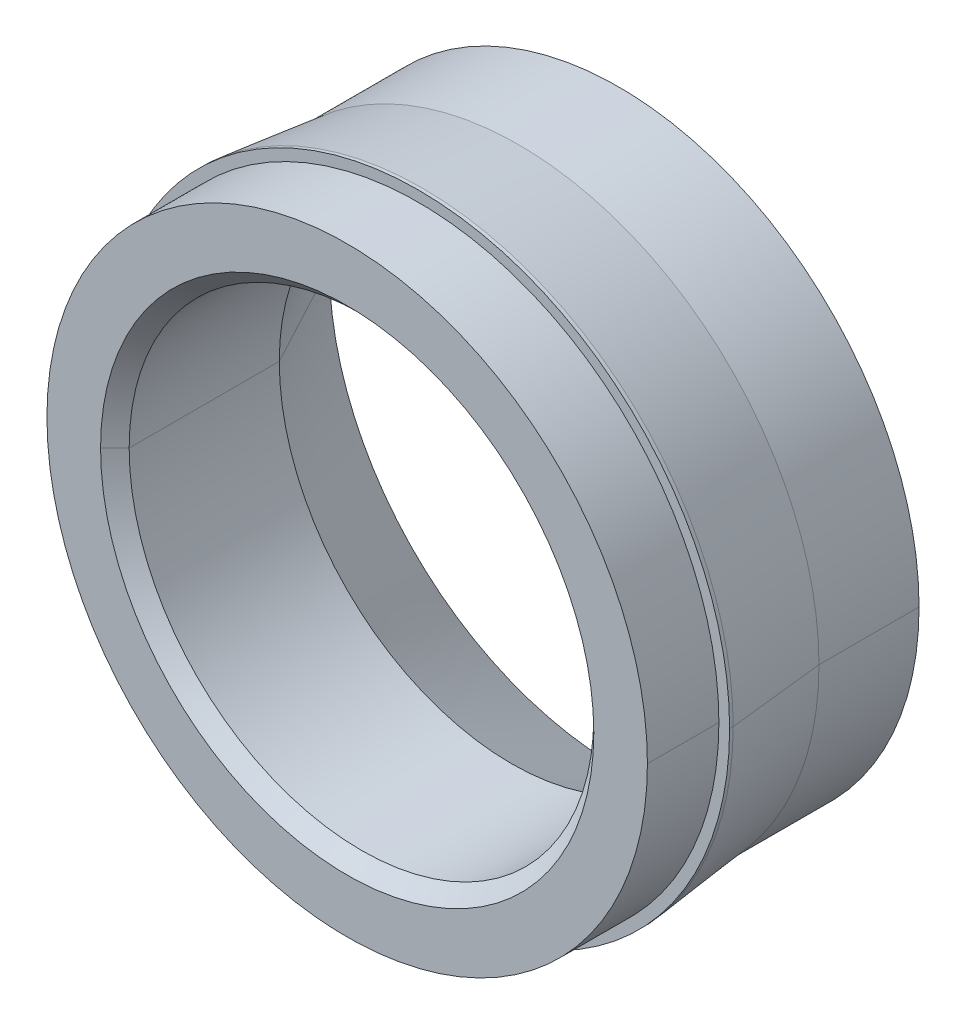
ISO-10303-21;
HEADER;
FILE_DESCRIPTION(('STEP AP214'),'2;1');
FILE_NAME('part.step','',(''),(''),'','','');
FILE_SCHEMA(('AUTOMOTIVE_DESIGN { 1 0 10303 214 1 1 1 1 }'));
ENDSEC;
DATA;
#1=APPLICATION_CONTEXT('core data for automotive mechanical design processes');
#2=APPLICATION_PROTOCOL_DEFINITION('international standard','automotive_design',2000,#1);
#3=PRODUCT_CONTEXT('',#1,'mechanical');
#4=PRODUCT('Part','Part','',(#3));
#5=PRODUCT_RELATED_PRODUCT_CATEGORY('part','',(#4));
#6=PRODUCT_DEFINITION_FORMATION('','',#4);
#7=PRODUCT_DEFINITION_CONTEXT('part definition',#1,'design');
#8=PRODUCT_DEFINITION('design','',#6,#7);
#9=PRODUCT_DEFINITION_SHAPE('','',#8);
#10=(LENGTH_UNIT() NAMED_UNIT(*) SI_UNIT(.MILLI.,.METRE.));
#11=(NAMED_UNIT(*) PLANE_ANGLE_UNIT() SI_UNIT($,.RADIAN.));
#12=(NAMED_UNIT(*) SI_UNIT($,.STERADIAN.) SOLID_ANGLE_UNIT());
#13=UNCERTAINTY_MEASURE_WITH_UNIT(LENGTH_MEASURE(1.E-05),#10,'distance_accuracy_value','');
#14=(GEOMETRIC_REPRESENTATION_CONTEXT(3) GLOBAL_UNCERTAINTY_ASSIGNED_CONTEXT((#13)) GLOBAL_UNIT_ASSIGNED_CONTEXT((#10,
#11,#12)) REPRESENTATION_CONTEXT('',''));
#15=CARTESIAN_POINT('',(0.,0.,0.));
#16=DIRECTION('',(0.,0.,1.));
#17=DIRECTION('',(1.,0.,0.));
#18=AXIS2_PLACEMENT_3D('',#15,#16,#17);
#19=CARTESIAN_POINT('',(0.,0.,2.075));
#20=DIRECTION('',(0.,0.,1.));
#21=DIRECTION('',(1.,0.,0.));
#22=AXIS2_PLACEMENT_3D('',#19,#20,#21);
#23=CONICAL_SURFACE('',#22,4.275,0.110657221173895);
#24=DIRECTION('',(-0.110431526074846,0.,0.993883734673619));
#25=VECTOR('',#24,1.);
#26=CARTESIAN_POINT('',(-4.275,0.,2.075));
#27=LINE('',#26,#25);
#28=CARTESIAN_POINT('',(-4.2,0.,1.4));
#29=VERTEX_POINT('',#28);
#30=CARTESIAN_POINT('',(-4.35,0.,2.75));
#31=VERTEX_POINT('',#30);
#32=EDGE_CURVE('E172',#29,#31,#27,.T.);
#33=ORIENTED_EDGE('',*,*,#32,.F.);
#34=CARTESIAN_POINT('',(0.,0.,1.4));
#35=DIRECTION('',(0.,0.,-1.));
#36=DIRECTION('',(1.,0.,0.));
#37=AXIS2_PLACEMENT_3D('',#34,#35,#36);
#38=CIRCLE('',#37,4.2);
#39=CARTESIAN_POINT('',(4.2,0.,1.4));
#40=VERTEX_POINT('',#39);
#41=EDGE_CURVE('E28',#40,#29,#38,.T.);
#42=ORIENTED_EDGE('',*,*,#41,.F.);
#43=DIRECTION('',(0.110431526074846,0.,0.993883734673619));
#44=VECTOR('',#43,1.);
#45=CARTESIAN_POINT('',(4.275,0.,2.075));
#46=LINE('',#45,#44);
#47=CARTESIAN_POINT('',(4.35,0.,2.75));
#48=VERTEX_POINT('',#47);
#49=EDGE_CURVE('E226',#40,#48,#46,.T.);
#50=ORIENTED_EDGE('',*,*,#49,.T.);
#51=CARTESIAN_POINT('',(0.,0.,2.75));
#52=DIRECTION('',(0.,0.,-1.));
#53=DIRECTION('',(1.,0.,0.));
#54=AXIS2_PLACEMENT_3D('',#51,#52,#53);
#55=CIRCLE('',#54,4.35);
#56=EDGE_CURVE('E159',#48,#31,#55,.T.);
#57=ORIENTED_EDGE('',*,*,#56,.T.);
#58=EDGE_LOOP('',(#33,#42,#50,#57));
#59=FACE_BOUND('',#58,.T.);
#60=ADVANCED_FACE('F17',(#59),#23,.T.);
#61=CARTESIAN_POINT('',(0.,0.,2.8));
#62=DIRECTION('',(0.,0.,-1.));
#63=DIRECTION('',(1.,0.,0.));
#64=AXIS2_PLACEMENT_3D('',#61,#62,#63);
#65=CYLINDRICAL_SURFACE('',#64,4.35);
#66=DIRECTION('',(0.,0.,-1.));
#67=VECTOR('',#66,1.);
#68=CARTESIAN_POINT('',(-4.35,0.,2.8));
#69=LINE('',#68,#67);
#70=CARTESIAN_POINT('',(-4.35,0.,2.8));
#71=VERTEX_POINT('',#70);
#72=EDGE_CURVE('E156',#71,#31,#69,.T.);
#73=ORIENTED_EDGE('',*,*,#72,.F.);
#74=CARTESIAN_POINT('',(0.,0.,2.8));
#75=DIRECTION('',(0.,0.,1.));
#76=DIRECTION('',(1.,0.,0.));
#77=AXIS2_PLACEMENT_3D('',#74,#75,#76);
#78=CIRCLE('',#77,4.35);
#79=CARTESIAN_POINT('',(4.35,0.,2.8));
#80=VERTEX_POINT('',#79);
#81=EDGE_CURVE('E11',#80,#71,#78,.T.);
#82=ORIENTED_EDGE('',*,*,#81,.F.);
#83=DIRECTION('',(0.,0.,-1.));
#84=VECTOR('',#83,1.);
#85=CARTESIAN_POINT('',(4.35,0.,2.8));
#86=LINE('',#85,#84);
#87=EDGE_CURVE('E193',#80,#48,#86,.T.);
#88=ORIENTED_EDGE('',*,*,#87,.T.);
#89=CARTESIAN_POINT('',(0.,0.,2.75));
#90=DIRECTION('',(0.,0.,-1.));
#91=DIRECTION('',(1.,0.,0.));
#92=AXIS2_PLACEMENT_3D('',#89,#90,#91);
#93=CIRCLE('',#92,4.35);
#94=EDGE_CURVE('E176',#31,#48,#93,.T.);
#95=ORIENTED_EDGE('',*,*,#94,.F.);
#96=EDGE_LOOP('',(#73,#82,#88,#95));
#97=FACE_BOUND('',#96,.T.);
#98=ADVANCED_FACE('F272',(#97),#65,.T.);
#99=CARTESIAN_POINT('',(0.,0.,2.8));
#100=DIRECTION('',(0.,0.,1.));
#101=DIRECTION('',(1.,0.,0.));
#102=AXIS2_PLACEMENT_3D('',#99,#100,#101);
#103=PLANE('',#102);
#104=CARTESIAN_POINT('',(0.,0.,2.8));
#105=DIRECTION('',(0.,0.,1.));
#106=DIRECTION('',(1.,0.,0.));
#107=AXIS2_PLACEMENT_3D('',#104,#105,#106);
#108=CIRCLE('',#107,4.2);
#109=CARTESIAN_POINT('',(4.2,0.,2.8));
#110=VERTEX_POINT('',#109);
#111=CARTESIAN_POINT('',(-4.2,0.,2.8));
#112=VERTEX_POINT('',#111);
#113=EDGE_CURVE('E192',#110,#112,#108,.T.);
#114=ORIENTED_EDGE('',*,*,#113,.F.);
#115=CARTESIAN_POINT('',(0.,0.,2.8));
#116=DIRECTION('',(0.,0.,1.));
#117=DIRECTION('',(1.,0.,0.));
#118=AXIS2_PLACEMENT_3D('',#115,#116,#117);
#119=CIRCLE('',#118,4.2);
#120=EDGE_CURVE('E79',#112,#110,#119,.T.);
#121=ORIENTED_EDGE('',*,*,#120,.F.);
#122=EDGE_LOOP('',(#114,#121));
#123=FACE_BOUND('',#122,.T.);
#124=ORIENTED_EDGE('',*,*,#81,.T.);
#125=CARTESIAN_POINT('',(0.,0.,2.8));
#126=DIRECTION('',(0.,0.,1.));
#127=DIRECTION('',(1.,0.,0.));
#128=AXIS2_PLACEMENT_3D('',#125,#126,#127);
#129=CIRCLE('',#128,4.35);
#130=EDGE_CURVE('E160',#71,#80,#129,.T.);
#131=ORIENTED_EDGE('',*,*,#130,.T.);
#132=EDGE_LOOP('',(#124,#131));
#133=FACE_BOUND('',#132,.T.);
#134=ADVANCED_FACE('F316',(#123,#133),#103,.T.);
#135=CARTESIAN_POINT('',(0.,0.,0.));
#136=DIRECTION('',(0.,0.,1.));
#137=DIRECTION('',(1.,0.,0.));
#138=AXIS2_PLACEMENT_3D('',#135,#136,#137);
#139=CYLINDRICAL_SURFACE('',#138,4.2);
#140=DIRECTION('',(0.,0.,1.));
#141=VECTOR('',#140,1.);
#142=CARTESIAN_POINT('',(-4.2,0.,0.));
#143=LINE('',#142,#141);
#144=CARTESIAN_POINT('',(-4.2,0.,0.));
#145=VERTEX_POINT('',#144);
#146=EDGE_CURVE('E180',#145,#29,#143,.T.);
#147=ORIENTED_EDGE('',*,*,#146,.F.);
#148=CARTESIAN_POINT('',(0.,0.,0.));
#149=DIRECTION('',(0.,0.,1.));
#150=DIRECTION('',(1.,0.,0.));
#151=AXIS2_PLACEMENT_3D('',#148,#149,#150);
#152=CIRCLE('',#151,4.2);
#153=CARTESIAN_POINT('',(4.2,0.,0.));
#154=VERTEX_POINT('',#153);
#155=EDGE_CURVE('E132',#145,#154,#152,.T.);
#156=ORIENTED_EDGE('',*,*,#155,.T.);
#157=DIRECTION('',(0.,0.,1.));
#158=VECTOR('',#157,1.);
#159=CARTESIAN_POINT('',(4.2,0.,0.));
#160=LINE('',#159,#158);
#161=EDGE_CURVE('E183',#154,#40,#160,.T.);
#162=ORIENTED_EDGE('',*,*,#161,.T.);
#163=ORIENTED_EDGE('',*,*,#41,.T.);
#164=EDGE_LOOP('',(#147,#156,#162,#163));
#165=FACE_BOUND('',#164,.T.);
#166=ADVANCED_FACE('F292',(#165),#139,.T.);
#167=CARTESIAN_POINT('',(0.,0.,0.75));
#168=DIRECTION('',(0.,0.,-1.));
#169=DIRECTION('',(1.,0.,0.));
#170=AXIS2_PLACEMENT_3D('',#167,#168,#169);
#171=CONICAL_SURFACE('',#170,3.65,0.489957326253728);
#172=DIRECTION('',(-0.470588235294117,0.,-0.882352941176471));
#173=VECTOR('',#172,1.);
#174=CARTESIAN_POINT('',(-3.65,0.,0.75));
#175=LINE('',#174,#173);
#176=CARTESIAN_POINT('',(-3.25,0.,1.5));
#177=VERTEX_POINT('',#176);
#178=CARTESIAN_POINT('',(-4.05,0.,0.));
#179=VERTEX_POINT('',#178);
#180=EDGE_CURVE('E146',#177,#179,#175,.T.);
#181=ORIENTED_EDGE('',*,*,#180,.F.);
#182=CARTESIAN_POINT('',(0.,0.,1.5));
#183=DIRECTION('',(0.,0.,1.));
#184=DIRECTION('',(1.,0.,0.));
#185=AXIS2_PLACEMENT_3D('',#182,#183,#184);
#186=CIRCLE('',#185,3.25);
#187=CARTESIAN_POINT('',(3.25,0.,1.5));
#188=VERTEX_POINT('',#187);
#189=EDGE_CURVE('E139',#177,#188,#186,.T.);
#190=ORIENTED_EDGE('',*,*,#189,.T.);
#191=DIRECTION('',(0.470588235294117,0.,-0.882352941176471));
#192=VECTOR('',#191,1.);
#193=CARTESIAN_POINT('',(3.65,0.,0.75));
#194=LINE('',#193,#192);
#195=CARTESIAN_POINT('',(4.05,0.,0.));
#196=VERTEX_POINT('',#195);
#197=EDGE_CURVE('E136',#188,#196,#194,.T.);
#198=ORIENTED_EDGE('',*,*,#197,.T.);
#199=CARTESIAN_POINT('',(0.,0.,0.));
#200=DIRECTION('',(0.,0.,-1.));
#201=DIRECTION('',(1.,0.,0.));
#202=AXIS2_PLACEMENT_3D('',#199,#200,#201);
#203=CIRCLE('',#202,4.05);
#204=EDGE_CURVE('E120',#196,#179,#203,.T.);
#205=ORIENTED_EDGE('',*,*,#204,.T.);
#206=EDGE_LOOP('',(#181,#190,#198,#205));
#207=FACE_BOUND('',#206,.T.);
#208=ADVANCED_FACE('F137',(#207),#171,.F.);
#209=CARTESIAN_POINT('',(0.,0.,0.));
#210=DIRECTION('',(0.,0.,1.));
#211=DIRECTION('',(1.,0.,0.));
#212=AXIS2_PLACEMENT_3D('',#209,#210,#211);
#213=CYLINDRICAL_SURFACE('',#212,3.25);
#214=DIRECTION('',(0.,0.,1.));
#215=VECTOR('',#214,1.);
#216=CARTESIAN_POINT('',(-3.25,0.,0.));
#217=LINE('',#216,#215);
#218=CARTESIAN_POINT('',(-3.25,0.,3.6));
#219=VERTEX_POINT('',#218);
#220=EDGE_CURVE('E161',#177,#219,#217,.T.);
#221=ORIENTED_EDGE('',*,*,#220,.F.);
#222=CARTESIAN_POINT('',(0.,0.,1.5));
#223=DIRECTION('',(0.,0.,1.));
#224=DIRECTION('',(1.,0.,0.));
#225=AXIS2_PLACEMENT_3D('',#222,#223,#224);
#226=CIRCLE('',#225,3.25);
#227=EDGE_CURVE('E21',#188,#177,#226,.T.);
#228=ORIENTED_EDGE('',*,*,#227,.F.);
#229=DIRECTION('',(0.,0.,1.));
#230=VECTOR('',#229,1.);
#231=CARTESIAN_POINT('',(3.25,0.,0.));
#232=LINE('',#231,#230);
#233=CARTESIAN_POINT('',(3.25,0.,3.6));
#234=VERTEX_POINT('',#233);
#235=EDGE_CURVE('E171',#188,#234,#232,.T.);
#236=ORIENTED_EDGE('',*,*,#235,.T.);
#237=CARTESIAN_POINT('',(0.,0.,3.6));
#238=DIRECTION('',(0.,0.,-1.));
#239=DIRECTION('',(1.,0.,0.));
#240=AXIS2_PLACEMENT_3D('',#237,#238,#239);
#241=CIRCLE('',#240,3.25);
#242=EDGE_CURVE('E208',#219,#234,#241,.T.);
#243=ORIENTED_EDGE('',*,*,#242,.F.);
#244=EDGE_LOOP('',(#221,#228,#236,#243));
#245=FACE_BOUND('',#244,.T.);
#246=ADVANCED_FACE('F298',(#245),#213,.F.);
#247=CARTESIAN_POINT('',(0.,0.,0.));
#248=DIRECTION('',(0.,0.,1.));
#249=DIRECTION('',(1.,0.,0.));
#250=AXIS2_PLACEMENT_3D('',#247,#248,#249);
#251=PLANE('',#250);
#252=ORIENTED_EDGE('',*,*,#204,.F.);
#253=CARTESIAN_POINT('',(0.,0.,0.));
#254=DIRECTION('',(0.,0.,-1.));
#255=DIRECTION('',(1.,0.,0.));
#256=AXIS2_PLACEMENT_3D('',#253,#254,#255);
#257=CIRCLE('',#256,4.05);
#258=EDGE_CURVE('E129',#179,#196,#257,.T.);
#259=ORIENTED_EDGE('',*,*,#258,.F.);
#260=EDGE_LOOP('',(#252,#259));
#261=FACE_BOUND('',#260,.T.);
#262=CARTESIAN_POINT('',(0.,0.,0.));
#263=DIRECTION('',(0.,0.,1.));
#264=DIRECTION('',(1.,0.,0.));
#265=AXIS2_PLACEMENT_3D('',#262,#263,#264);
#266=CIRCLE('',#265,4.2);
#267=EDGE_CURVE('E184',#154,#145,#266,.T.);
#268=ORIENTED_EDGE('',*,*,#267,.F.);
#269=ORIENTED_EDGE('',*,*,#155,.F.);
#270=EDGE_LOOP('',(#268,#269));
#271=FACE_BOUND('',#270,.T.);
#272=ADVANCED_FACE('F126',(#261,#271),#251,.F.);
#273=CARTESIAN_POINT('',(0.,0.,3.7));
#274=DIRECTION('',(0.,0.,1.));
#275=DIRECTION('',(1.,0.,0.));
#276=AXIS2_PLACEMENT_3D('',#273,#274,#275);
#277=CONICAL_SURFACE('',#276,3.35,0.785398163397448);
#278=DIRECTION('',(-0.707106781186547,0.,0.707106781186548));
#279=VECTOR('',#278,1.);
#280=CARTESIAN_POINT('',(-3.35,0.,3.7));
#281=LINE('',#280,#279);
#282=CARTESIAN_POINT('',(-3.45,0.,3.8));
#283=VERTEX_POINT('',#282);
#284=EDGE_CURVE('E166',#219,#283,#281,.T.);
#285=ORIENTED_EDGE('',*,*,#284,.F.);
#286=ORIENTED_EDGE('',*,*,#242,.T.);
#287=DIRECTION('',(0.707106781186547,0.,0.707106781186548));
#288=VECTOR('',#287,1.);
#289=CARTESIAN_POINT('',(3.35,0.,3.7));
#290=LINE('',#289,#288);
#291=CARTESIAN_POINT('',(3.45,0.,3.8));
#292=VERTEX_POINT('',#291);
#293=EDGE_CURVE('E189',#234,#292,#290,.T.);
#294=ORIENTED_EDGE('',*,*,#293,.T.);
#295=CARTESIAN_POINT('',(0.,0.,3.8));
#296=DIRECTION('',(0.,0.,1.));
#297=DIRECTION('',(1.,0.,0.));
#298=AXIS2_PLACEMENT_3D('',#295,#296,#297);
#299=CIRCLE('',#298,3.45);
#300=EDGE_CURVE('E67',#292,#283,#299,.T.);
#301=ORIENTED_EDGE('',*,*,#300,.T.);
#302=EDGE_LOOP('',(#285,#286,#294,#301));
#303=FACE_BOUND('',#302,.T.);
#304=ADVANCED_FACE('F297',(#303),#277,.F.);
#305=CARTESIAN_POINT('',(0.,0.,3.8));
#306=DIRECTION('',(0.,0.,1.));
#307=DIRECTION('',(1.,0.,0.));
#308=AXIS2_PLACEMENT_3D('',#305,#306,#307);
#309=PLANE('',#308);
#310=ORIENTED_EDGE('',*,*,#300,.F.);
#311=CARTESIAN_POINT('',(0.,0.,3.8));
#312=DIRECTION('',(0.,0.,1.));
#313=DIRECTION('',(1.,0.,0.));
#314=AXIS2_PLACEMENT_3D('',#311,#312,#313);
#315=CIRCLE('',#314,3.45);
#316=EDGE_CURVE('E170',#283,#292,#315,.T.);
#317=ORIENTED_EDGE('',*,*,#316,.F.);
#318=EDGE_LOOP('',(#310,#317));
#319=FACE_BOUND('',#318,.T.);
#320=CARTESIAN_POINT('',(0.,0.,3.8));
#321=DIRECTION('',(0.,0.,1.));
#322=DIRECTION('',(1.,0.,0.));
#323=AXIS2_PLACEMENT_3D('',#320,#321,#322);
#324=CIRCLE('',#323,4.2);
#325=CARTESIAN_POINT('',(4.2,0.,3.8));
#326=VERTEX_POINT('',#325);
#327=CARTESIAN_POINT('',(-4.2,0.,3.8));
#328=VERTEX_POINT('',#327);
#329=EDGE_CURVE('E202',#326,#328,#324,.T.);
#330=ORIENTED_EDGE('',*,*,#329,.T.);
#331=CARTESIAN_POINT('',(0.,0.,3.8));
#332=DIRECTION('',(0.,0.,1.));
#333=DIRECTION('',(1.,0.,0.));
#334=AXIS2_PLACEMENT_3D('',#331,#332,#333);
#335=CIRCLE('',#334,4.2);
#336=EDGE_CURVE('E42',#328,#326,#335,.T.);
#337=ORIENTED_EDGE('',*,*,#336,.T.);
#338=EDGE_LOOP('',(#330,#337));
#339=FACE_BOUND('',#338,.T.);
#340=ADVANCED_FACE('F305',(#319,#339),#309,.T.);
#341=CARTESIAN_POINT('',(0.,0.,0.));
#342=DIRECTION('',(0.,0.,1.));
#343=DIRECTION('',(1.,0.,0.));
#344=AXIS2_PLACEMENT_3D('',#341,#342,#343);
#345=CYLINDRICAL_SURFACE('',#344,4.2);
#346=DIRECTION('',(0.,0.,1.));
#347=VECTOR('',#346,1.);
#348=CARTESIAN_POINT('',(-4.2,0.,0.));
#349=LINE('',#348,#347);
#350=EDGE_CURVE('E219',#112,#328,#349,.T.);
#351=ORIENTED_EDGE('',*,*,#350,.F.);
#352=ORIENTED_EDGE('',*,*,#120,.T.);
#353=DIRECTION('',(0.,0.,1.));
#354=VECTOR('',#353,1.);
#355=CARTESIAN_POINT('',(4.2,0.,0.));
#356=LINE('',#355,#354);
#357=EDGE_CURVE('E199',#110,#326,#356,.T.);
#358=ORIENTED_EDGE('',*,*,#357,.T.);
#359=ORIENTED_EDGE('',*,*,#336,.F.);
#360=EDGE_LOOP('',(#351,#352,#358,#359));
#361=FACE_BOUND('',#360,.T.);
#362=ADVANCED_FACE('F324',(#361),#345,.T.);
#363=CARTESIAN_POINT('',(0.,0.,0.));
#364=DIRECTION('',(0.,0.,1.));
#365=DIRECTION('',(1.,0.,0.));
#366=AXIS2_PLACEMENT_3D('',#363,#364,#365);
#367=CYLINDRICAL_SURFACE('',#366,4.2);
#368=ORIENTED_EDGE('',*,*,#113,.T.);
#369=ORIENTED_EDGE('',*,*,#350,.T.);
#370=ORIENTED_EDGE('',*,*,#329,.F.);
#371=ORIENTED_EDGE('',*,*,#357,.F.);
#372=EDGE_LOOP('',(#368,#369,#370,#371));
#373=FACE_BOUND('',#372,.T.);
#374=ADVANCED_FACE('F320',(#373),#367,.T.);
#375=CARTESIAN_POINT('',(0.,0.,3.7));
#376=DIRECTION('',(0.,0.,1.));
#377=DIRECTION('',(1.,0.,0.));
#378=AXIS2_PLACEMENT_3D('',#375,#376,#377);
#379=CONICAL_SURFACE('',#378,3.35,0.785398163397448);
#380=CARTESIAN_POINT('',(0.,0.,3.6));
#381=DIRECTION('',(0.,0.,-1.));
#382=DIRECTION('',(1.,0.,0.));
#383=AXIS2_PLACEMENT_3D('',#380,#381,#382);
#384=CIRCLE('',#383,3.25);
#385=EDGE_CURVE('E165',#234,#219,#384,.T.);
#386=ORIENTED_EDGE('',*,*,#385,.T.);
#387=ORIENTED_EDGE('',*,*,#284,.T.);
#388=ORIENTED_EDGE('',*,*,#316,.T.);
#389=ORIENTED_EDGE('',*,*,#293,.F.);
#390=EDGE_LOOP('',(#386,#387,#388,#389));
#391=FACE_BOUND('',#390,.T.);
#392=ADVANCED_FACE('F323',(#391),#379,.F.);
#393=CARTESIAN_POINT('',(0.,0.,0.));
#394=DIRECTION('',(0.,0.,1.));
#395=DIRECTION('',(1.,0.,0.));
#396=AXIS2_PLACEMENT_3D('',#393,#394,#395);
#397=CYLINDRICAL_SURFACE('',#396,3.25);
#398=ORIENTED_EDGE('',*,*,#189,.F.);
#399=ORIENTED_EDGE('',*,*,#220,.T.);
#400=ORIENTED_EDGE('',*,*,#385,.F.);
#401=ORIENTED_EDGE('',*,*,#235,.F.);
#402=EDGE_LOOP('',(#398,#399,#400,#401));
#403=FACE_BOUND('',#402,.T.);
#404=ADVANCED_FACE('F328',(#403),#397,.F.);
#405=CARTESIAN_POINT('',(0.,0.,0.75));
#406=DIRECTION('',(0.,0.,-1.));
#407=DIRECTION('',(1.,0.,0.));
#408=AXIS2_PLACEMENT_3D('',#405,#406,#407);
#409=CONICAL_SURFACE('',#408,3.65,0.489957326253728);
#410=ORIENTED_EDGE('',*,*,#227,.T.);
#411=ORIENTED_EDGE('',*,*,#180,.T.);
#412=ORIENTED_EDGE('',*,*,#258,.T.);
#413=ORIENTED_EDGE('',*,*,#197,.F.);
#414=EDGE_LOOP('',(#410,#411,#412,#413));
#415=FACE_BOUND('',#414,.T.);
#416=ADVANCED_FACE('F145',(#415),#409,.F.);
#417=CARTESIAN_POINT('',(0.,0.,0.));
#418=DIRECTION('',(0.,0.,1.));
#419=DIRECTION('',(1.,0.,0.));
#420=AXIS2_PLACEMENT_3D('',#417,#418,#419);
#421=CYLINDRICAL_SURFACE('',#420,4.2);
#422=ORIENTED_EDGE('',*,*,#267,.T.);
#423=ORIENTED_EDGE('',*,*,#146,.T.);
#424=CARTESIAN_POINT('',(0.,0.,1.4));
#425=DIRECTION('',(0.,0.,-1.));
#426=DIRECTION('',(1.,0.,0.));
#427=AXIS2_PLACEMENT_3D('',#424,#425,#426);
#428=CIRCLE('',#427,4.2);
#429=EDGE_CURVE('E177',#29,#40,#428,.T.);
#430=ORIENTED_EDGE('',*,*,#429,.T.);
#431=ORIENTED_EDGE('',*,*,#161,.F.);
#432=EDGE_LOOP('',(#422,#423,#430,#431));
#433=FACE_BOUND('',#432,.T.);
#434=ADVANCED_FACE('F19',(#433),#421,.T.);
#435=CARTESIAN_POINT('',(0.,0.,2.8));
#436=DIRECTION('',(0.,0.,-1.));
#437=DIRECTION('',(1.,0.,0.));
#438=AXIS2_PLACEMENT_3D('',#435,#436,#437);
#439=CYLINDRICAL_SURFACE('',#438,4.35);
#440=ORIENTED_EDGE('',*,*,#130,.F.);
#441=ORIENTED_EDGE('',*,*,#72,.T.);
#442=ORIENTED_EDGE('',*,*,#56,.F.);
#443=ORIENTED_EDGE('',*,*,#87,.F.);
#444=EDGE_LOOP('',(#440,#441,#442,#443));
#445=FACE_BOUND('',#444,.T.);
#446=ADVANCED_FACE('F276',(#445),#439,.T.);
#447=CARTESIAN_POINT('',(0.,0.,2.075));
#448=DIRECTION('',(0.,0.,1.));
#449=DIRECTION('',(1.,0.,0.));
#450=AXIS2_PLACEMENT_3D('',#447,#448,#449);
#451=CONICAL_SURFACE('',#450,4.275,0.110657221173895);
#452=ORIENTED_EDGE('',*,*,#429,.F.);
#453=ORIENTED_EDGE('',*,*,#32,.T.);
#454=ORIENTED_EDGE('',*,*,#94,.T.);
#455=ORIENTED_EDGE('',*,*,#49,.F.);
#456=EDGE_LOOP('',(#452,#453,#454,#455));
#457=FACE_BOUND('',#456,.T.);
#458=ADVANCED_FACE('F269',(#457),#451,.T.);
#459=CLOSED_SHELL('',(#60,#98,#134,#166,#208,#246,#272,#304,#340,#362,#374,#392,#404,#416,#434,
#446,#458));
#460=MANIFOLD_SOLID_BREP('B1',#459);
#461=ADVANCED_BREP_SHAPE_REPRESENTATION('',(#18,#460),#14);
#462=SHAPE_DEFINITION_REPRESENTATION(#9,#461);
ENDSEC;
END-ISO-10303-21;
